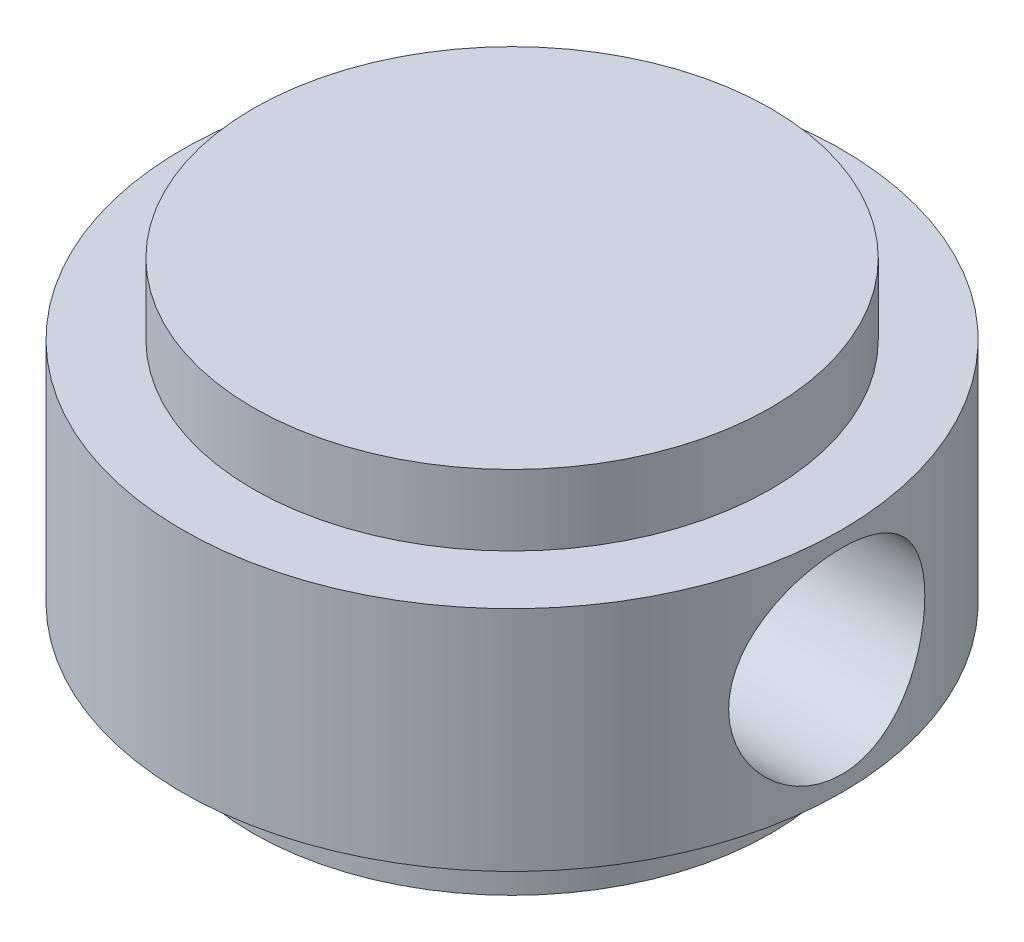
ISO-10303-21;
HEADER;
FILE_DESCRIPTION(('STEP AP214'),'2;1');
FILE_NAME('part.step','',(''),(''),'','','');
FILE_SCHEMA(('AUTOMOTIVE_DESIGN { 1 0 10303 214 1 1 1 1 }'));
ENDSEC;
DATA;
#1=APPLICATION_CONTEXT('core data for automotive mechanical design processes');
#2=APPLICATION_PROTOCOL_DEFINITION('international standard','automotive_design',2000,#1);
#3=PRODUCT_CONTEXT('',#1,'mechanical');
#4=PRODUCT('Part','Part','',(#3));
#5=PRODUCT_RELATED_PRODUCT_CATEGORY('part','',(#4));
#6=PRODUCT_DEFINITION_FORMATION('','',#4);
#7=PRODUCT_DEFINITION_CONTEXT('part definition',#1,'design');
#8=PRODUCT_DEFINITION('design','',#6,#7);
#9=PRODUCT_DEFINITION_SHAPE('','',#8);
#10=(LENGTH_UNIT() NAMED_UNIT(*) SI_UNIT(.MILLI.,.METRE.));
#11=(NAMED_UNIT(*) PLANE_ANGLE_UNIT() SI_UNIT($,.RADIAN.));
#12=(NAMED_UNIT(*) SI_UNIT($,.STERADIAN.) SOLID_ANGLE_UNIT());
#13=UNCERTAINTY_MEASURE_WITH_UNIT(LENGTH_MEASURE(1.E-05),#10,'distance_accuracy_value','');
#14=(GEOMETRIC_REPRESENTATION_CONTEXT(3) GLOBAL_UNCERTAINTY_ASSIGNED_CONTEXT((#13)) GLOBAL_UNIT_ASSIGNED_CONTEXT((#10,
#11,#12)) REPRESENTATION_CONTEXT('',''));
#15=CARTESIAN_POINT('',(0.,0.,0.));
#16=DIRECTION('',(0.,0.,1.));
#17=DIRECTION('',(1.,0.,0.));
#18=AXIS2_PLACEMENT_3D('',#15,#16,#17);
#19=CARTESIAN_POINT('',(0.,-23.4980000000005,0.));
#20=DIRECTION('',(0.,-1.,0.));
#21=DIRECTION('',(0.,0.,-1.));
#22=AXIS2_PLACEMENT_3D('',#19,#20,#21);
#23=PLANE('',#22);
#24=CARTESIAN_POINT('',(0.,-23.4980000000005,0.));
#25=DIRECTION('',(0.,-1.,0.));
#26=DIRECTION('',(1.,0.,0.));
#27=AXIS2_PLACEMENT_3D('',#24,#25,#26);
#28=CIRCLE('',#27,33.);
#29=CARTESIAN_POINT('',(33.,-23.4980000000005,0.));
#30=VERTEX_POINT('',#29);
#31=EDGE_CURVE('E18',#30,#30,#28,.F.);
#32=ORIENTED_EDGE('',*,*,#31,.F.);
#33=EDGE_LOOP('',(#32));
#34=FACE_BOUND('',#33,.T.);
#35=ADVANCED_FACE('F14',(#34),#23,.T.);
#36=CARTESIAN_POINT('',(0.,0.00199999999954403,0.));
#37=DIRECTION('',(0.,-1.,0.));
#38=DIRECTION('',(1.,0.,0.));
#39=AXIS2_PLACEMENT_3D('',#36,#37,#38);
#40=CYLINDRICAL_SURFACE('',#39,33.);
#41=CARTESIAN_POINT('',(0.,-14.4980000000005,0.));
#42=DIRECTION('',(0.,-1.,0.));
#43=DIRECTION('',(1.,0.,0.));
#44=AXIS2_PLACEMENT_3D('',#41,#42,#43);
#45=CIRCLE('',#44,33.);
#46=CARTESIAN_POINT('',(33.,-14.4980000000005,0.));
#47=VERTEX_POINT('',#46);
#48=EDGE_CURVE('E55',#47,#47,#45,.F.);
#49=ORIENTED_EDGE('',*,*,#48,.F.);
#50=EDGE_LOOP('',(#49));
#51=FACE_BOUND('',#50,.T.);
#52=ORIENTED_EDGE('',*,*,#31,.T.);
#53=EDGE_LOOP('',(#52));
#54=FACE_BOUND('',#53,.T.);
#55=ADVANCED_FACE('F62',(#51,#54),#40,.T.);
#56=CARTESIAN_POINT('',(33.,-14.4980000000005,0.));
#57=DIRECTION('',(0.,-1.,0.));
#58=DIRECTION('',(0.,0.,-1.));
#59=AXIS2_PLACEMENT_3D('',#56,#57,#58);
#60=PLANE('',#59);
#61=CARTESIAN_POINT('',(0.,-14.4980000000005,0.));
#62=DIRECTION('',(0.,-1.,0.));
#63=DIRECTION('',(1.,0.,0.));
#64=AXIS2_PLACEMENT_3D('',#61,#62,#63);
#65=CIRCLE('',#64,42.);
#66=CARTESIAN_POINT('',(42.,-14.4980000000005,0.));
#67=VERTEX_POINT('',#66);
#68=EDGE_CURVE('E39',#67,#67,#65,.F.);
#69=ORIENTED_EDGE('',*,*,#68,.F.);
#70=EDGE_LOOP('',(#69));
#71=FACE_BOUND('',#70,.T.);
#72=ORIENTED_EDGE('',*,*,#48,.T.);
#73=EDGE_LOOP('',(#72));
#74=FACE_BOUND('',#73,.T.);
#75=ADVANCED_FACE('F70',(#71,#74),#60,.T.);
#76=CARTESIAN_POINT('',(-42.504,0.00199999999954403,0.));
#77=DIRECTION('',(1.,0.,0.));
#78=DIRECTION('',(0.,0.,-1.));
#79=AXIS2_PLACEMENT_3D('',#76,#77,#78);
#80=CYLINDRICAL_SURFACE('',#79,12.5);
#81=CARTESIAN_POINT('',(40.096757973682,0.00199999999954342,-12.5000000000002));
#82=CARTESIAN_POINT('',(40.0967529310049,-0.340553838329251,-12.5000064412297));
#83=CARTESIAN_POINT('',(40.1011568286773,-0.683030388726293,-12.4859131462841));
#84=CARTESIAN_POINT('',(40.1186232265058,-1.36555628130523,-12.4296821293819));
#85=CARTESIAN_POINT('',(40.1316874164862,-1.70560513669614,-12.3875389342314));
#86=CARTESIAN_POINT('',(40.1660872929354,-2.38094781440073,-12.2755382597118));
#87=CARTESIAN_POINT('',(40.1874296173093,-2.71623759638223,-12.20565853848));
#88=CARTESIAN_POINT('',(40.2377278426519,-3.37943062586443,-12.038805728202));
#89=CARTESIAN_POINT('',(40.2666840187437,-3.70733360598139,-11.9418316601059));
#90=CARTESIAN_POINT('',(40.3312779014217,-4.35287534339752,-11.7218226313557));
#91=CARTESIAN_POINT('',(40.3669025974646,-4.67053269895063,-11.5988383579689));
#92=CARTESIAN_POINT('',(40.4438348261758,-5.29418251164461,-11.3276685074508));
#93=CARTESIAN_POINT('',(40.4851424133063,-5.60017485695732,-11.179482688796));
#94=CARTESIAN_POINT('',(40.5722665950855,-6.19851784976762,-10.8590391508081));
#95=CARTESIAN_POINT('',(40.6180822114605,-6.49087143676029,-10.68678665072));
#96=CARTESIAN_POINT('',(40.7129938626,-7.06034657637418,-10.319309241553));
#97=CARTESIAN_POINT('',(40.7620910775326,-7.33746258305856,-10.1240760484599));
#98=CARTESIAN_POINT('',(40.8636363859589,-7.8821847585073,-9.70622021707568));
#99=CARTESIAN_POINT('',(40.9161396855504,-8.14931254921193,-9.48298714359001));
#100=CARTESIAN_POINT('',(41.0217921873008,-8.66407962754595,-9.01499437877976));
#101=CARTESIAN_POINT('',(41.0749416739485,-8.91170994400992,-8.77022488654715));
#102=CARTESIAN_POINT('',(41.1804372361921,-9.38585719266003,-8.2607069832355));
#103=CARTESIAN_POINT('',(41.2327830406109,-9.61236712377812,-7.99595199954287));
#104=CARTESIAN_POINT('',(41.3352172151515,-10.0425918067524,-7.4483134019293));
#105=CARTESIAN_POINT('',(41.3853065924933,-10.2463167907545,-7.1654380159146));
#106=CARTESIAN_POINT('',(41.4829276854028,-10.6337505439993,-6.57704304619733));
#107=CARTESIAN_POINT('',(41.5303826192951,-10.816943119201,-6.27117043395984));
#108=CARTESIAN_POINT('',(41.6201940401669,-11.1567364397239,-5.64443283319628));
#109=CARTESIAN_POINT('',(41.6625525046501,-11.3133475088029,-5.32357372716825));
#110=CARTESIAN_POINT('',(41.7409475382948,-11.5986691474219,-4.66923272274531));
#111=CARTESIAN_POINT('',(41.7769892625818,-11.7274024885329,-4.33576139005649));
#112=CARTESIAN_POINT('',(41.8417400600164,-11.9559758708939,-3.65849319914944));
#113=CARTESIAN_POINT('',(41.8704509613245,-12.0558231165863,-3.31469893921061));
#114=CARTESIAN_POINT('',(41.9293581599708,-12.2590824088048,-2.48275077711679));
#115=CARTESIAN_POINT('',(41.9557241397029,-12.3485462259539,-1.99084122700691));
#116=CARTESIAN_POINT('',(41.9910414700719,-12.4679988190213,-0.99923296527227));
#117=CARTESIAN_POINT('',(41.9999937487468,-12.4979907644091,-0.49953467016824));
#118=CARTESIAN_POINT('',(42.0000042914994,-12.4980063402546,0.342931676420958));
#119=CARTESIAN_POINT('',(41.9957924513959,-12.4838822688355,0.685786238807914));
#120=CARTESIAN_POINT('',(41.9790700359922,-12.4275252091833,1.36907876489094));
#121=CARTESIAN_POINT('',(41.9665578533356,-12.3852867766158,1.70951624761289));
#122=CARTESIAN_POINT('',(41.9335586123324,-12.273023390668,2.38565863780899));
#123=CARTESIAN_POINT('',(41.9130650077095,-12.2029756274583,2.72135942548881));
#124=CARTESIAN_POINT('',(41.8646647884542,-12.0357141944092,3.38535738482942));
#125=CARTESIAN_POINT('',(41.8367585032603,-11.9385017318289,3.71365488480808));
#126=CARTESIAN_POINT('',(41.7743368711005,-11.7179139400617,4.36005123753912));
#127=CARTESIAN_POINT('',(41.7398328967649,-11.5945835922749,4.67816655583472));
#128=CARTESIAN_POINT('',(41.665097283399,-11.3226375435521,5.30269621462111));
#129=CARTESIAN_POINT('',(41.6248655892199,-11.1740215991537,5.60911044241318));
#130=CARTESIAN_POINT('',(41.5397339227663,-10.8526527432785,6.20822377575112));
#131=CARTESIAN_POINT('',(41.4948350980692,-10.6799057616861,6.50092622725954));
#132=CARTESIAN_POINT('',(41.401499859208,-10.3113877429156,7.07101728415447));
#133=CARTESIAN_POINT('',(41.3530620898055,-10.1156078675934,7.34839995067182));
#134=CARTESIAN_POINT('',(41.2526601813946,-9.69718745062771,7.89281703941495));
#135=CARTESIAN_POINT('',(41.2006381012425,-9.47399689534984,8.15941817084093));
#136=CARTESIAN_POINT('',(41.09556814095,-9.00620073006423,8.67312287838275));
#137=CARTESIAN_POINT('',(41.0425198029424,-8.76158538125948,8.92021748961829));
#138=CARTESIAN_POINT('',(40.9368355548635,-8.25248456951555,9.39331016530815));
#139=CARTESIAN_POINT('',(40.8841998022535,-7.98799189278345,9.61930050331347));
#140=CARTESIAN_POINT('',(40.78082855104,-7.44098759814374,10.0485195094633));
#141=CARTESIAN_POINT('',(40.7300922126195,-7.15848409661882,10.2517583181251));
#142=CARTESIAN_POINT('',(40.6307872325604,-6.57042331886695,10.6386059025377));
#143=CARTESIAN_POINT('',(40.582295134205,-6.26448559310091,10.8216566609988));
#144=CARTESIAN_POINT('',(40.4902386982233,-5.63763644636897,11.1611606742805));
#145=CARTESIAN_POINT('',(40.4466724480316,-5.31673090581133,11.3176242640843));
#146=CARTESIAN_POINT('',(40.3658323519791,-4.66230131046167,11.602652084832));
#147=CARTESIAN_POINT('',(40.3285532124355,-4.32878816376309,11.7312398132706));
#148=CARTESIAN_POINT('',(40.2614431385875,-3.65141572909564,11.9595281813961));
#149=CARTESIAN_POINT('',(40.231610312696,-3.30755909360401,12.059236158441));
#150=CARTESIAN_POINT('',(40.1703959161522,-2.47640818486952,12.2619222444797));
#151=CARTESIAN_POINT('',(40.1429308069909,-1.98537570224896,12.3510687788763));
#152=CARTESIAN_POINT('',(40.1061160785811,-0.995507220146972,12.4701010957737));
#153=CARTESIAN_POINT('',(40.0967653145429,-0.496671715809323,12.4999906231996));
#154=CARTESIAN_POINT('',(40.096752931004,0.344553838328574,12.5000064412295));
#155=CARTESIAN_POINT('',(40.1011568286769,0.687030388725787,12.4859131462847));
#156=CARTESIAN_POINT('',(40.1186232265057,1.36955628130478,12.4296821293827));
#157=CARTESIAN_POINT('',(40.131687416486,1.70960513669556,12.3875389342317));
#158=CARTESIAN_POINT('',(40.1660872929352,2.38494781440057,12.2755382597128));
#159=CARTESIAN_POINT('',(40.1874296173091,2.72023759638262,12.2056585384822));
#160=CARTESIAN_POINT('',(40.2377278426518,3.38343062586423,12.0388057282008));
#161=CARTESIAN_POINT('',(40.2666840187436,3.71133360598007,11.9418316600998));
#162=CARTESIAN_POINT('',(40.3312779014217,4.35687534339704,11.7218226313493));
#163=CARTESIAN_POINT('',(40.3669025974648,4.6745326989521,11.5988383579669));
#164=CARTESIAN_POINT('',(40.443834826176,5.2981825116474,11.3276685074516));
#165=CARTESIAN_POINT('',(40.4851424133065,5.6041748569595,11.1794826887953));
#166=CARTESIAN_POINT('',(40.5722665950859,6.20251784976986,10.859039150807));
#167=CARTESIAN_POINT('',(40.6180822114612,6.49487143676321,10.68678665072));
#168=CARTESIAN_POINT('',(40.7129938626,7.06434657637554,10.3193092415506));
#169=CARTESIAN_POINT('',(40.7620910775316,7.34146258305767,10.124076048454));
#170=CARTESIAN_POINT('',(40.8636363859579,7.88618475850663,9.7062202170691));
#171=CARTESIAN_POINT('',(40.9161396855506,8.15331254921383,9.48298714358647));
#172=CARTESIAN_POINT('',(41.0217921873018,8.66807962754946,9.0149943787782));
#173=CARTESIAN_POINT('',(41.0749416739492,8.91570994401248,8.77022488654453));
#174=CARTESIAN_POINT('',(41.1804372361927,9.38985719266234,8.26070698323241));
#175=CARTESIAN_POINT('',(41.2327830406117,9.61636712378113,7.99595199954037));
#176=CARTESIAN_POINT('',(41.3352172151519,10.0465918067538,7.44831340192534));
#177=CARTESIAN_POINT('',(41.3853065924933,10.2503167907536,7.16543801590859));
#178=CARTESIAN_POINT('',(41.4829276854028,10.6377505439983,6.57704304619073));
#179=CARTESIAN_POINT('',(41.5303826192956,10.8209431192022,6.27117043395479));
#180=CARTESIAN_POINT('',(41.6201940401677,11.1607364397265,5.6444328331924));
#181=CARTESIAN_POINT('',(41.6625525046506,11.3173475088046,5.32357372716398));
#182=CARTESIAN_POINT('',(41.7409475382953,11.6026691474228,4.66923272274099));
#183=CARTESIAN_POINT('',(41.7769892625825,11.7314024885339,4.33576139005249));
#184=CARTESIAN_POINT('',(41.8417400600164,11.9599758708942,3.65849319914551));
#185=CARTESIAN_POINT('',(41.8704509613237,12.0598231165857,3.31469893920642));
#186=CARTESIAN_POINT('',(41.9293581599695,12.2630824088033,2.48275077711308));
#187=CARTESIAN_POINT('',(41.9557241397026,12.3525462259531,1.99084122700414));
#188=CARTESIAN_POINT('',(41.9910414700723,12.4719988190209,0.999232965271035));
#189=CARTESIAN_POINT('',(41.9999937487469,12.5019907644083,0.499534670167588));
#190=CARTESIAN_POINT('',(42.0000042914993,12.5020063402537,-0.342931676421464));
#191=CARTESIAN_POINT('',(41.9957924513959,12.4878822688345,-0.685786238808894));
#192=CARTESIAN_POINT('',(41.9790700359921,12.4315252091821,-1.36907876489295));
#193=CARTESIAN_POINT('',(41.9665578533355,12.3892867766146,-1.70951624761545));
#194=CARTESIAN_POINT('',(41.9335586123322,12.2770233906661,-2.38565863781245));
#195=CARTESIAN_POINT('',(41.9130650077091,12.2069756274558,-2.72135942549261));
#196=CARTESIAN_POINT('',(41.864664788454,12.0397141944072,-3.38535738483445));
#197=CARTESIAN_POINT('',(41.8367585032604,11.9425017318281,-3.71365488481398));
#198=CARTESIAN_POINT('',(41.7743368711005,11.7219139400605,-4.36005123754499));
#199=CARTESIAN_POINT('',(41.7398328967645,11.5985835922722,-4.6781665558397));
#200=CARTESIAN_POINT('',(41.6650972833983,11.3266375435483,-5.30269621462523));
#201=CARTESIAN_POINT('',(41.6248655892193,11.1780215991504,-5.60911044241733));
#202=CARTESIAN_POINT('',(41.5397339227658,10.856652743275,-6.20822377575471));
#203=CARTESIAN_POINT('',(41.4948350980685,10.6839057616821,-6.50092622726253));
#204=CARTESIAN_POINT('',(41.4014998592076,10.3153877429127,-7.07101728415781));
#205=CARTESIAN_POINT('',(41.3530620898054,10.1196078675922,-7.34839995067611));
#206=CARTESIAN_POINT('',(41.2526601813946,9.70118745062663,-7.89281703941872));
#207=CARTESIAN_POINT('',(41.2006381012422,9.47799689534722,-8.15941817084319));
#208=CARTESIAN_POINT('',(41.0955681409496,9.01020073006052,-8.67312287838395));
#209=CARTESIAN_POINT('',(41.0425198029421,8.76558538125621,-8.92021748961995));
#210=CARTESIAN_POINT('',(40.9368355548632,8.2564845695121,-9.39331016530955));
#211=CARTESIAN_POINT('',(40.8841998022531,7.99199189277938,-9.61930050331414));
#212=CARTESIAN_POINT('',(40.7808285510397,7.44498759814064,-10.0485195094653));
#213=CARTESIAN_POINT('',(40.7300922126195,7.16248409661733,-10.2517583181293));
#214=CARTESIAN_POINT('',(40.6307872325605,6.57442331886569,-10.6386059025415));
#215=CARTESIAN_POINT('',(40.5822951342049,6.26848559309821,-10.8216566610002));
#216=CARTESIAN_POINT('',(40.4902386982231,5.64163644636526,-11.1611606742802));
#217=CARTESIAN_POINT('',(40.4466724480315,5.32073090580803,-11.3176242640847));
#218=CARTESIAN_POINT('',(40.3658323519791,4.66630131045847,-11.6026520848322));
#219=CARTESIAN_POINT('',(40.3285532124355,4.33278816375958,-11.7312398132698));
#220=CARTESIAN_POINT('',(40.2614431385875,3.65541572909283,-11.959528181397));
#221=CARTESIAN_POINT('',(40.231610312696,3.31155909360222,-12.0592361584446));
#222=CARTESIAN_POINT('',(40.1703959161522,2.48040818486874,-12.2619222444842));
#223=CARTESIAN_POINT('',(40.1429308069908,1.98937570224764,-12.3510687788767));
#224=CARTESIAN_POINT('',(40.1061160785816,0.999507220145475,-12.470101095772));
#225=CARTESIAN_POINT('',(40.096765314544,0.500671715808185,-12.4999906231997));
#226=CARTESIAN_POINT('',(40.096757973682,0.00199999999954342,-12.5000000000002));
#227=B_SPLINE_CURVE_WITH_KNOTS('',3,(#81,#82,#83,#84,#85,#86,#87,#88,#89,#90,#91,#92,#93,#94,
#95,#96,#97,#98,#99,#100,#101,#102,#103,#104,#105,#106,#107,#108,#109,#110,#111,#112,#113,#114,
#115,#116,#117,#118,#119,#120,#121,#122,#123,#124,#125,#126,#127,#128,#129,#130,#131,#132,#133,
#134,#135,#136,#137,#138,#139,#140,#141,#142,#143,#144,#145,#146,#147,#148,#149,#150,#151,#152,
#153,#154,#155,#156,#157,#158,#159,#160,#161,#162,#163,#164,#165,#166,#167,#168,#169,#170,#171,
#172,#173,#174,#175,#176,#177,#178,#179,#180,#181,#182,#183,#184,#185,#186,#187,#188,#189,#190,
#191,#192,#193,#194,#195,#196,#197,#198,#199,#200,#201,#202,#203,#204,#205,#206,#207,#208,#209,
#210,#211,#212,#213,#214,#215,#216,#217,#218,#219,#220,#221,#222,#223,#224,#225,#226),
.UNSPECIFIED.,.T.,.F.,(4,2,2,2,2,2,2,2,2,2,2,2,2,2,2,2,2,2,2,2,2,2,2,2,2,2,2,2,2,2,2,2,2,2,2,2,
2,2,2,2,2,2,2,2,2,2,2,2,2,2,2,2,2,2,2,2,2,2,2,2,2,2,2,2,2,2,2,2,2,2,2,2,4),(0.,1.02721122183568,
2.05462293546736,3.08286019832496,4.11113462118482,5.13742336482141,6.16372194463668,
7.18979829965748,8.21624567104222,9.27122161497981,10.3266801710497,11.3824873600233,
12.4378184924722,13.5155332560312,14.5928284928595,15.6692404073468,16.7453836234729,
18.2434139267943,19.7413643925593,20.769710761886,21.7982563280189,22.8276472787911,
23.8569924884344,24.8845791246451,25.9121756555331,26.9395201108832,27.9672600708794,
29.020745296834,30.0747119024661,31.1290628735357,32.1829420259991,33.2610245035673,
34.3386869446899,35.4154374252071,36.4919140997781,37.9873682470501,39.4827278815819,
40.5099391034181,41.5373508170497,42.5655880799078,43.5938625027687,44.6201512464062,
45.6464498262216,46.6725261812425,47.6989735526275,48.7539494965658,49.8094080526355,
50.8652152416092,51.9205463740589,52.9982611376179,54.0755563744456,55.1519682889323,
56.2281115050582,57.7261418083775,59.2240922741405,60.2524386434687,61.2809842096031,
62.3103751603769,63.3397203700216,64.3673070062315,65.394903537119,66.4222479924685,
67.449987952464,68.5034731784181,69.5574397840503,70.61179075512,71.6656699075831,
72.743752385151,73.8214148262736,74.8981653067907,75.974641981361,77.4700961286321,
78.9654557631635),.UNSPECIFIED.);
#228=CARTESIAN_POINT('',(40.096757973682,0.00199999999954342,-12.5000000000002));
#229=VERTEX_POINT('',#228);
#230=EDGE_CURVE('E32',#229,#229,#227,.T.);
#231=ORIENTED_EDGE('',*,*,#230,.F.);
#232=EDGE_LOOP('',(#231));
#233=FACE_BOUND('',#232,.T.);
#234=CARTESIAN_POINT('',(-42.,12.5019999999995,0.));
#235=CARTESIAN_POINT('',(-42.0000042914994,12.5020063402537,0.342931676420961));
#236=CARTESIAN_POINT('',(-41.9957924513959,12.4878822688346,0.685786238807917));
#237=CARTESIAN_POINT('',(-41.9790700359922,12.4315252091823,1.36907876489095));
#238=CARTESIAN_POINT('',(-41.9665578533356,12.3892867766148,1.7095162476129));
#239=CARTESIAN_POINT('',(-41.9335586123324,12.277023390667,2.385658637809));
#240=CARTESIAN_POINT('',(-41.9130650077095,12.2069756274573,2.72135942548881));
#241=CARTESIAN_POINT('',(-41.8646647884542,12.0397141944082,3.38535738482942));
#242=CARTESIAN_POINT('',(-41.8367585032603,11.9425017318279,3.71365488480808));
#243=CARTESIAN_POINT('',(-41.7743368711005,11.7219139400607,4.36005123753911));
#244=CARTESIAN_POINT('',(-41.7398328967649,11.5985835922739,4.67816655583469));
#245=CARTESIAN_POINT('',(-41.665097283399,11.326637543551,5.30269621462106));
#246=CARTESIAN_POINT('',(-41.6248655892199,11.1780215991527,5.60911044241313));
#247=CARTESIAN_POINT('',(-41.5397339227664,10.8566527432774,6.20822377575105));
#248=CARTESIAN_POINT('',(-41.4948350980692,10.6839057616849,6.50092622725946));
#249=CARTESIAN_POINT('',(-41.401499859208,10.3153877429145,7.07101728415442));
#250=CARTESIAN_POINT('',(-41.3530620898054,10.1196078675924,7.34839995067183));
#251=CARTESIAN_POINT('',(-41.2526601813945,9.70118745062667,7.89281703941496));
#252=CARTESIAN_POINT('',(-41.2006381012425,9.47799689534869,8.1594181708409));
#253=CARTESIAN_POINT('',(-41.0955681409501,9.01020073006296,8.6731228783827));
#254=CARTESIAN_POINT('',(-41.0425198029425,8.76558538125821,8.92021748961828));
#255=CARTESIAN_POINT('',(-40.9368355548635,8.25648456951425,9.39331016530813));
#256=CARTESIAN_POINT('',(-40.8841998022535,7.99199189278212,9.61930050331342));
#257=CARTESIAN_POINT('',(-40.78082855104,7.44498759814243,10.0485195094632));
#258=CARTESIAN_POINT('',(-40.7300922126195,7.16248409661756,10.2517583181252));
#259=CARTESIAN_POINT('',(-40.6307872325605,6.57442331886576,10.6386059025376));
#260=CARTESIAN_POINT('',(-40.582295134205,6.26848559309975,10.8216566609986));
#261=CARTESIAN_POINT('',(-40.4902386982234,5.64163644636789,11.1611606742802));
#262=CARTESIAN_POINT('',(-40.4466724480317,5.32073090581029,11.3176242640839));
#263=CARTESIAN_POINT('',(-40.3658323519793,4.66630131046078,11.6026520848318));
#264=CARTESIAN_POINT('',(-40.3285532124356,4.33278816376232,11.7312398132706));
#265=CARTESIAN_POINT('',(-40.2614431385876,3.65541572909469,11.9595281813954));
#266=CARTESIAN_POINT('',(-40.2316103126961,3.31155909360276,12.0592361584392));
#267=CARTESIAN_POINT('',(-40.1703959161521,2.48040818486808,12.2619222444774));
#268=CARTESIAN_POINT('',(-40.1429308069907,1.98937570224781,12.3510687788753));
#269=CARTESIAN_POINT('',(-40.1061160785815,0.999507220146075,12.470101095774));
#270=CARTESIAN_POINT('',(-40.0967653145441,0.50067171580839,12.4999906231998));
#271=CARTESIAN_POINT('',(-40.0967529310049,-0.340553838329476,12.5000064412294));
#272=CARTESIAN_POINT('',(-40.1011568286772,-0.683030388726654,12.4859131462844));
#273=CARTESIAN_POINT('',(-40.1186232265056,-1.36555628130559,12.4296821293823));
#274=CARTESIAN_POINT('',(-40.1316874164861,-1.70560513669636,12.3875389342314));
#275=CARTESIAN_POINT('',(-40.1660872929354,-2.38094781440135,12.2755382597125));
#276=CARTESIAN_POINT('',(-40.1874296173093,-2.71623759638338,12.2056585384818));
#277=CARTESIAN_POINT('',(-40.2377278426519,-3.37943062586506,12.0388057282005));
#278=CARTESIAN_POINT('',(-40.2666840187437,-3.70733360598096,11.9418316600998));
#279=CARTESIAN_POINT('',(-40.3312779014218,-4.35287534339792,11.7218226313494));
#280=CARTESIAN_POINT('',(-40.3669025974649,-4.67053269895291,11.5988383579666));
#281=CARTESIAN_POINT('',(-40.4438348261761,-5.29418251164817,11.3276685074512));
#282=CARTESIAN_POINT('',(-40.4851424133066,-5.6001748569603,11.1794826887949));
#283=CARTESIAN_POINT('',(-40.5722665950859,-6.19851784977068,10.8590391508067));
#284=CARTESIAN_POINT('',(-40.618082211461,-6.49087143676402,10.6867866507196));
#285=CARTESIAN_POINT('',(-40.7129938626003,-7.06034657637636,10.3193092415504));
#286=CARTESIAN_POINT('',(-40.7620910775326,-7.33746258305852,10.1240760484539));
#287=CARTESIAN_POINT('',(-40.8636363859589,-7.88218475850746,9.70622021706911));
#288=CARTESIAN_POINT('',(-40.9161396855509,-8.14931254921463,9.48298714358629));
#289=CARTESIAN_POINT('',(-41.0217921873016,-8.66407962755024,9.01499437877788));
#290=CARTESIAN_POINT('',(-41.0749416739492,-8.91170994401328,8.77022488654429));
#291=CARTESIAN_POINT('',(-41.1804372361927,-9.38585719266315,8.26070698323216));
#292=CARTESIAN_POINT('',(-41.2327830406115,-9.61236712378193,7.99595199954005));
#293=CARTESIAN_POINT('',(-41.3352172151523,-10.0425918067546,7.44831340192514));
#294=CARTESIAN_POINT('',(-41.3853065924944,-10.2463167907545,7.16543801590857));
#295=CARTESIAN_POINT('',(-41.4829276854039,-10.6337505439991,6.57704304619075));
#296=CARTESIAN_POINT('',(-41.5303826192959,-10.816943119203,6.27117043395465));
#297=CARTESIAN_POINT('',(-41.6201940401674,-11.1567364397273,5.64443283319216));
#298=CARTESIAN_POINT('',(-41.6625525046506,-11.3133475088054,5.3235737271638));
#299=CARTESIAN_POINT('',(-41.7409475382953,-11.5986691474236,4.66923272274084));
#300=CARTESIAN_POINT('',(-41.7769892625823,-11.7274024885348,4.33576139005232));
#301=CARTESIAN_POINT('',(-41.8417400600166,-11.955975870895,3.65849319914539));
#302=CARTESIAN_POINT('',(-41.8704509613246,-12.0558231165866,3.31469893920639));
#303=CARTESIAN_POINT('',(-41.9293581599706,-12.2590824088042,2.48275077711311));
#304=CARTESIAN_POINT('',(-41.9557241397029,-12.348546225954,1.99084122700412));
#305=CARTESIAN_POINT('',(-41.991041470072,-12.4679988190217,0.999232965270992));
#306=CARTESIAN_POINT('',(-41.9999937487469,-12.4979907644092,0.499534670167574));
#307=CARTESIAN_POINT('',(-42.0000042914994,-12.4980063402546,-0.342931676421457));
#308=CARTESIAN_POINT('',(-41.9957924513959,-12.4838822688354,-0.685786238808885));
#309=CARTESIAN_POINT('',(-41.9790700359921,-12.4275252091831,-1.36907876489293));
#310=CARTESIAN_POINT('',(-41.9665578533355,-12.3852867766155,-1.70951624761543));
#311=CARTESIAN_POINT('',(-41.9335586123322,-12.2730233906671,-2.38565863781245));
#312=CARTESIAN_POINT('',(-41.9130650077091,-12.2029756274568,-2.72135942549263));
#313=CARTESIAN_POINT('',(-41.8646647884539,-12.0357141944082,-3.38535738483446));
#314=CARTESIAN_POINT('',(-41.8367585032604,-11.9385017318291,-3.71365488481398));
#315=CARTESIAN_POINT('',(-41.7743368711005,-11.7179139400615,-4.36005123754511));
#316=CARTESIAN_POINT('',(-41.7398328967645,-11.5945835922732,-4.67816655583994));
#317=CARTESIAN_POINT('',(-41.6650972833982,-11.3226375435492,-5.30269621462577));
#318=CARTESIAN_POINT('',(-41.6248655892192,-11.1740215991512,-5.60911044241803));
#319=CARTESIAN_POINT('',(-41.5397339227656,-10.8526527432756,-6.20822377575556));
#320=CARTESIAN_POINT('',(-41.4948350980683,-10.6799057616824,-6.50092622726337));
#321=CARTESIAN_POINT('',(-41.4014998592074,-10.3113877429133,-7.0710172841592));
#322=CARTESIAN_POINT('',(-41.3530620898053,-10.1156078675933,-7.34839995067805));
#323=CARTESIAN_POINT('',(-41.2526601813945,-9.69718745062768,-7.89281703942064));
#324=CARTESIAN_POINT('',(-41.2006381012421,-9.47399689534766,-8.15941817084452));
#325=CARTESIAN_POINT('',(-41.0955681409493,-9.00620073006053,-8.67312287838488));
#326=CARTESIAN_POINT('',(-41.0425198029419,-8.76158538125638,-8.92021748962107));
#327=CARTESIAN_POINT('',(-40.9368355548629,-8.25248456951223,-9.39331016531057));
#328=CARTESIAN_POINT('',(-40.8841998022528,-7.98799189277928,-9.61930050331489));
#329=CARTESIAN_POINT('',(-40.7808285510395,-7.44098759814094,-10.0485195094666));
#330=CARTESIAN_POINT('',(-40.7300922126195,-7.15848409661824,-10.2517583181313));
#331=CARTESIAN_POINT('',(-40.6307872325605,-6.57042331886679,-10.6386059025434));
#332=CARTESIAN_POINT('',(-40.5822951342048,-6.26448559309887,-10.8216566610011));
#333=CARTESIAN_POINT('',(-40.4902386982229,-5.63763644636566,-11.1611606742803));
#334=CARTESIAN_POINT('',(-40.4466724480314,-5.31673090580863,-11.3176242640851));
#335=CARTESIAN_POINT('',(-40.365832351979,-4.66230131045928,-11.6026520848327));
#336=CARTESIAN_POINT('',(-40.3285532124353,-4.32878816376042,-11.7312398132703));
#337=CARTESIAN_POINT('',(-40.2614431385874,-3.6514157290937,-11.9595281813973));
#338=CARTESIAN_POINT('',(-40.231610312696,-3.30755909360309,-12.0592361584446));
#339=CARTESIAN_POINT('',(-40.1703959161522,-2.47640818486962,-12.2619222444842));
#340=CARTESIAN_POINT('',(-40.1429308069907,-1.98537570224855,-12.3510687788771));
#341=CARTESIAN_POINT('',(-40.1061160785815,-0.995507220146399,-12.4701010957723));
#342=CARTESIAN_POINT('',(-40.096765314544,-0.49667171580908,-12.4999906231997));
#343=CARTESIAN_POINT('',(-40.0967529310049,0.344553838328399,-12.5000064412298));
#344=CARTESIAN_POINT('',(-40.1011568286772,0.687030388725459,-12.4859131462844));
#345=CARTESIAN_POINT('',(-40.1186232265056,1.3695562813044,-12.4296821293823));
#346=CARTESIAN_POINT('',(-40.1316874164861,1.7096051366953,-12.3875389342318));
#347=CARTESIAN_POINT('',(-40.1660872929353,2.3849478143999,-12.2755382597122));
#348=CARTESIAN_POINT('',(-40.1874296173092,2.72023759638144,-12.2056585384804));
#349=CARTESIAN_POINT('',(-40.2377278426518,3.38343062586359,-12.0388057282023));
#350=CARTESIAN_POINT('',(-40.2666840187438,3.71133360598048,-11.9418316601059));
#351=CARTESIAN_POINT('',(-40.3312779014218,4.35687534339666,-11.7218226313557));
#352=CARTESIAN_POINT('',(-40.3669025974646,4.67453269894988,-11.5988383579691));
#353=CARTESIAN_POINT('',(-40.4438348261757,5.29818251164393,-11.3276685074511));
#354=CARTESIAN_POINT('',(-40.4851424133062,5.6041748569566,-11.1794826887962));
#355=CARTESIAN_POINT('',(-40.5722665950855,6.2025178497669,-10.8590391508084));
#356=CARTESIAN_POINT('',(-40.6180822114604,6.4948714367596,-10.6867866507203));
#357=CARTESIAN_POINT('',(-40.7129938626,7.0643465763734,-10.3193092415532));
#358=CARTESIAN_POINT('',(-40.7620910775326,7.34146258305765,-10.1240760484599));
#359=CARTESIAN_POINT('',(-40.8636363859589,7.88618475850641,-9.70622021707565));
#360=CARTESIAN_POINT('',(-40.9161396855504,8.1533125492112,-9.48298714359012));
#361=CARTESIAN_POINT('',(-41.0217921873008,8.66807962754533,-9.01499437877994));
#362=CARTESIAN_POINT('',(-41.0749416739486,8.91570994400926,-8.77022488654728));
#363=CARTESIAN_POINT('',(-41.180437236192,9.38985719265938,-8.26070698323555));
#364=CARTESIAN_POINT('',(-41.2327830406107,9.61636712377753,-7.99595199954291));
#365=CARTESIAN_POINT('',(-41.3352172151518,10.0465918067517,-7.44831340192933));
#366=CARTESIAN_POINT('',(-41.3853065924944,10.2503167907536,-7.16543801591462));
#367=CARTESIAN_POINT('',(-41.4829276854039,10.6377505439984,-6.57704304619733));
#368=CARTESIAN_POINT('',(-41.5303826192954,10.8209431192002,-6.27117043395982));
#369=CARTESIAN_POINT('',(-41.6201940401666,11.1607364397233,-5.64443283319625));
#370=CARTESIAN_POINT('',(-41.66255250465,11.3173475088022,-5.32357372716823));
#371=CARTESIAN_POINT('',(-41.7409475382948,11.6026691474211,-4.66923272274531));
#372=CARTESIAN_POINT('',(-41.7769892625818,11.7314024885321,-4.3357613900565));
#373=CARTESIAN_POINT('',(-41.8417400600163,11.9599758708931,-3.65849319914944));
#374=CARTESIAN_POINT('',(-41.8704509613245,12.0598231165854,-3.31469893921061));
#375=CARTESIAN_POINT('',(-41.9293581599708,12.2630824088039,-2.48275077711678));
#376=CARTESIAN_POINT('',(-41.9557241397029,12.352546225953,-1.99084122700691));
#377=CARTESIAN_POINT('',(-41.9910414700719,12.4719988190204,-0.999232965272273));
#378=CARTESIAN_POINT('',(-41.9999937487468,12.5019907644082,-0.49953467016824));
#379=CARTESIAN_POINT('',(-42.,12.5019999999995,0.));
#380=B_SPLINE_CURVE_WITH_KNOTS('',3,(#234,#235,#236,#237,#238,#239,#240,#241,#242,#243,#244,
#245,#246,#247,#248,#249,#250,#251,#252,#253,#254,#255,#256,#257,#258,#259,#260,#261,#262,#263,
#264,#265,#266,#267,#268,#269,#270,#271,#272,#273,#274,#275,#276,#277,#278,#279,#280,#281,#282,
#283,#284,#285,#286,#287,#288,#289,#290,#291,#292,#293,#294,#295,#296,#297,#298,#299,#300,#301,
#302,#303,#304,#305,#306,#307,#308,#309,#310,#311,#312,#313,#314,#315,#316,#317,#318,#319,#320,
#321,#322,#323,#324,#325,#326,#327,#328,#329,#330,#331,#332,#333,#334,#335,#336,#337,#338,#339,
#340,#341,#342,#343,#344,#345,#346,#347,#348,#349,#350,#351,#352,#353,#354,#355,#356,#357,#358,
#359,#360,#361,#362,#363,#364,#365,#366,#367,#368,#369,#370,#371,#372,#373,#374,#375,#376,#377,
#378,#379),.UNSPECIFIED.,.T.,.F.,(4,2,2,2,2,2,2,2,2,2,2,2,2,2,2,2,2,2,2,2,2,2,2,2,2,2,2,2,2,2,2,
2,2,2,2,2,2,2,2,2,2,2,2,2,2,2,2,2,2,2,2,2,2,2,2,2,2,2,2,2,2,2,2,2,2,2,2,2,2,2,2,2,4),(0.,
1.02834636932672,2.05689193545964,3.08628288623181,4.11562809587517,5.14321473208586,
6.17081126297377,7.19815571832391,8.22589567832014,9.27938090427482,10.333347509907,
11.3876984809765,12.44157763344,13.5196601110079,14.5973225521303,15.6740730326474,
16.7505497072185,18.2460038544904,19.7413634890221,20.7685747108582,21.7959864244898,
22.8242236873479,23.8524981102088,24.8787868538463,25.9050854336617,26.9311617886826,
27.9576091600676,29.0125851040059,30.0680436600756,31.1238508490493,32.179181981499,
33.2568967450579,34.3341919818857,35.4106038963724,36.4867471124982,37.9847774158175,
39.4827278815804,40.5110742509086,41.5396198170431,42.5690107678168,43.5983559774615,
44.6259426136718,45.6535391445597,46.6808835999098,47.7086235599056,48.7621087858595,
49.8160753914917,50.8704263625615,51.9243055150244,53.002387992592,54.0800504337143,
55.1568009142314,56.2332775888014,57.7287317360726,59.2240913706041,60.2513025924398,
61.2787143060714,62.3069515689291,63.335225991789,64.3615147354256,65.3878133152409,
66.4138896702617,67.4403370416464,68.4953129855841,69.550771541654,70.6065787306276,
71.6619098630766,72.7396246266356,73.8169198634639,74.8933317779511,75.9694749940772,
77.4675052973986,78.9654557631636),.UNSPECIFIED.);
#381=CARTESIAN_POINT('',(-42.,12.5019999999995,0.));
#382=VERTEX_POINT('',#381);
#383=EDGE_CURVE('E51',#382,#382,#380,.T.);
#384=ORIENTED_EDGE('',*,*,#383,.F.);
#385=EDGE_LOOP('',(#384));
#386=FACE_BOUND('',#385,.T.);
#387=ADVANCED_FACE('F41',(#233,#386),#80,.F.);
#388=CARTESIAN_POINT('',(0.,0.00199999999954403,0.));
#389=DIRECTION('',(0.,-1.,0.));
#390=DIRECTION('',(1.,0.,0.));
#391=AXIS2_PLACEMENT_3D('',#388,#389,#390);
#392=CYLINDRICAL_SURFACE('',#391,42.);
#393=CARTESIAN_POINT('',(0.,14.5019999999995,0.));
#394=DIRECTION('',(0.,-1.,0.));
#395=DIRECTION('',(1.,0.,0.));
#396=AXIS2_PLACEMENT_3D('',#393,#394,#395);
#397=CIRCLE('',#396,42.);
#398=CARTESIAN_POINT('',(42.,14.5019999999995,0.));
#399=VERTEX_POINT('',#398);
#400=EDGE_CURVE('E27',#399,#399,#397,.F.);
#401=ORIENTED_EDGE('',*,*,#400,.F.);
#402=EDGE_LOOP('',(#401));
#403=FACE_BOUND('',#402,.T.);
#404=ORIENTED_EDGE('',*,*,#383,.T.);
#405=EDGE_LOOP('',(#404));
#406=FACE_BOUND('',#405,.T.);
#407=ORIENTED_EDGE('',*,*,#68,.T.);
#408=EDGE_LOOP('',(#407));
#409=FACE_BOUND('',#408,.T.);
#410=ORIENTED_EDGE('',*,*,#230,.T.);
#411=EDGE_LOOP('',(#410));
#412=FACE_BOUND('',#411,.T.);
#413=ADVANCED_FACE('F44',(#403,#406,#409,#412),#392,.T.);
#414=CARTESIAN_POINT('',(42.,14.5019999999995,0.));
#415=DIRECTION('',(0.,1.,0.));
#416=DIRECTION('',(0.,0.,1.));
#417=AXIS2_PLACEMENT_3D('',#414,#415,#416);
#418=PLANE('',#417);
#419=CARTESIAN_POINT('',(0.,14.5019999999995,0.));
#420=DIRECTION('',(0.,-1.,0.));
#421=DIRECTION('',(1.,0.,0.));
#422=AXIS2_PLACEMENT_3D('',#419,#420,#421);
#423=CIRCLE('',#422,33.);
#424=CARTESIAN_POINT('',(33.,14.5019999999995,0.));
#425=VERTEX_POINT('',#424);
#426=EDGE_CURVE('E22',#425,#425,#423,.F.);
#427=ORIENTED_EDGE('',*,*,#426,.F.);
#428=EDGE_LOOP('',(#427));
#429=FACE_BOUND('',#428,.T.);
#430=ORIENTED_EDGE('',*,*,#400,.T.);
#431=EDGE_LOOP('',(#430));
#432=FACE_BOUND('',#431,.T.);
#433=ADVANCED_FACE('F48',(#429,#432),#418,.T.);
#434=CARTESIAN_POINT('',(0.,0.00199999999954403,0.));
#435=DIRECTION('',(0.,-1.,0.));
#436=DIRECTION('',(1.,0.,0.));
#437=AXIS2_PLACEMENT_3D('',#434,#435,#436);
#438=CYLINDRICAL_SURFACE('',#437,33.);
#439=ORIENTED_EDGE('',*,*,#426,.T.);
#440=EDGE_LOOP('',(#439));
#441=FACE_BOUND('',#440,.T.);
#442=CARTESIAN_POINT('',(0.,23.5019999999996,0.));
#443=DIRECTION('',(0.,-1.,0.));
#444=DIRECTION('',(1.,0.,0.));
#445=AXIS2_PLACEMENT_3D('',#442,#443,#444);
#446=CIRCLE('',#445,33.);
#447=CARTESIAN_POINT('',(33.,23.5019999999995,0.));
#448=VERTEX_POINT('',#447);
#449=EDGE_CURVE('E9',#448,#448,#446,.F.);
#450=ORIENTED_EDGE('',*,*,#449,.F.);
#451=EDGE_LOOP('',(#450));
#452=FACE_BOUND('',#451,.T.);
#453=ADVANCED_FACE('F74',(#441,#452),#438,.T.);
#454=CARTESIAN_POINT('',(33.,23.5019999999996,0.));
#455=DIRECTION('',(0.,1.,0.));
#456=DIRECTION('',(0.,0.,1.));
#457=AXIS2_PLACEMENT_3D('',#454,#455,#456);
#458=PLANE('',#457);
#459=ORIENTED_EDGE('',*,*,#449,.T.);
#460=EDGE_LOOP('',(#459));
#461=FACE_BOUND('',#460,.T.);
#462=ADVANCED_FACE('F16',(#461),#458,.T.);
#463=CLOSED_SHELL('',(#35,#55,#75,#387,#413,#433,#453,#462));
#464=MANIFOLD_SOLID_BREP('B1',#463);
#465=ADVANCED_BREP_SHAPE_REPRESENTATION('',(#18,#464),#14);
#466=SHAPE_DEFINITION_REPRESENTATION(#9,#465);
ENDSEC;
END-ISO-10303-21;
